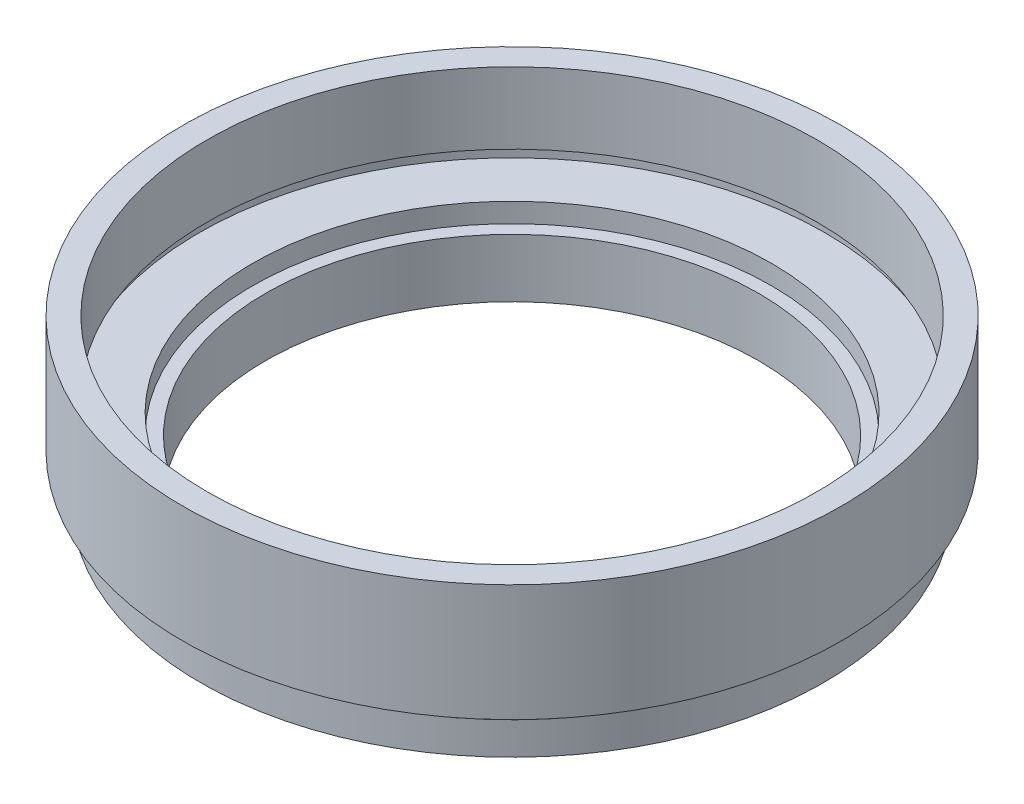
ISO-10303-21;
HEADER;
FILE_DESCRIPTION(('STEP AP214'),'2;1');
FILE_NAME('part.step','',(''),(''),'','','');
FILE_SCHEMA(('AUTOMOTIVE_DESIGN { 1 0 10303 214 1 1 1 1 }'));
ENDSEC;
DATA;
#1=APPLICATION_CONTEXT('core data for automotive mechanical design processes');
#2=APPLICATION_PROTOCOL_DEFINITION('international standard','automotive_design',2000,#1);
#3=PRODUCT_CONTEXT('',#1,'mechanical');
#4=PRODUCT('Part','Part','',(#3));
#5=PRODUCT_RELATED_PRODUCT_CATEGORY('part','',(#4));
#6=PRODUCT_DEFINITION_FORMATION('','',#4);
#7=PRODUCT_DEFINITION_CONTEXT('part definition',#1,'design');
#8=PRODUCT_DEFINITION('design','',#6,#7);
#9=PRODUCT_DEFINITION_SHAPE('','',#8);
#10=(LENGTH_UNIT() NAMED_UNIT(*) SI_UNIT(.MILLI.,.METRE.));
#11=(NAMED_UNIT(*) PLANE_ANGLE_UNIT() SI_UNIT($,.RADIAN.));
#12=(NAMED_UNIT(*) SI_UNIT($,.STERADIAN.) SOLID_ANGLE_UNIT());
#13=UNCERTAINTY_MEASURE_WITH_UNIT(LENGTH_MEASURE(1.E-05),#10,'distance_accuracy_value','');
#14=(GEOMETRIC_REPRESENTATION_CONTEXT(3) GLOBAL_UNCERTAINTY_ASSIGNED_CONTEXT((#13)) GLOBAL_UNIT_ASSIGNED_CONTEXT((#10,
#11,#12)) REPRESENTATION_CONTEXT('',''));
#15=CARTESIAN_POINT('',(0.,0.,0.));
#16=DIRECTION('',(0.,0.,1.));
#17=DIRECTION('',(1.,0.,0.));
#18=AXIS2_PLACEMENT_3D('',#15,#16,#17);
#19=CARTESIAN_POINT('',(0.,0.,0.));
#20=DIRECTION('',(0.,-1.,0.));
#21=DIRECTION('',(0.,0.,-1.));
#22=AXIS2_PLACEMENT_3D('',#19,#20,#21);
#23=CYLINDRICAL_SURFACE('',#22,19.);
#24=CARTESIAN_POINT('',(0.,0.,0.));
#25=DIRECTION('',(0.,-1.,0.));
#26=DIRECTION('',(0.,0.,-1.));
#27=AXIS2_PLACEMENT_3D('',#24,#25,#26);
#28=CIRCLE('',#27,19.);
#29=CARTESIAN_POINT('',(0.,0.,-19.));
#30=VERTEX_POINT('',#29);
#31=EDGE_CURVE('E10',#30,#30,#28,.T.);
#32=ORIENTED_EDGE('',*,*,#31,.T.);
#33=EDGE_LOOP('',(#32));
#34=FACE_BOUND('',#33,.T.);
#35=CARTESIAN_POINT('',(0.,4.5,0.));
#36=DIRECTION('',(0.,-1.,0.));
#37=DIRECTION('',(0.,0.,-1.));
#38=AXIS2_PLACEMENT_3D('',#35,#36,#37);
#39=CIRCLE('',#38,19.);
#40=CARTESIAN_POINT('',(0.,4.5,-19.));
#41=VERTEX_POINT('',#40);
#42=EDGE_CURVE('E79',#41,#41,#39,.T.);
#43=ORIENTED_EDGE('',*,*,#42,.F.);
#44=EDGE_LOOP('',(#43));
#45=FACE_BOUND('',#44,.T.);
#46=ADVANCED_FACE('F33',(#34,#45),#23,.F.);
#47=CARTESIAN_POINT('',(19.,0.,0.));
#48=DIRECTION('',(0.,-1.,0.));
#49=DIRECTION('',(0.,0.,-1.));
#50=AXIS2_PLACEMENT_3D('',#47,#48,#49);
#51=PLANE('',#50);
#52=CARTESIAN_POINT('',(0.,0.,0.));
#53=DIRECTION('',(0.,-1.,0.));
#54=DIRECTION('',(0.,0.,-1.));
#55=AXIS2_PLACEMENT_3D('',#52,#53,#54);
#56=CIRCLE('',#55,24.);
#57=CARTESIAN_POINT('',(0.,0.,-24.));
#58=VERTEX_POINT('',#57);
#59=EDGE_CURVE('E39',#58,#58,#56,.T.);
#60=ORIENTED_EDGE('',*,*,#59,.T.);
#61=EDGE_LOOP('',(#60));
#62=FACE_BOUND('',#61,.T.);
#63=ORIENTED_EDGE('',*,*,#31,.F.);
#64=EDGE_LOOP('',(#63));
#65=FACE_BOUND('',#64,.T.);
#66=ADVANCED_FACE('F87',(#62,#65),#51,.T.);
#67=CARTESIAN_POINT('',(0.,0.,0.));
#68=DIRECTION('',(0.,-1.,0.));
#69=DIRECTION('',(0.,0.,-1.));
#70=AXIS2_PLACEMENT_3D('',#67,#68,#69);
#71=CYLINDRICAL_SURFACE('',#70,24.);
#72=CARTESIAN_POINT('',(0.,2.5,0.));
#73=DIRECTION('',(0.,-1.,0.));
#74=DIRECTION('',(0.,0.,-1.));
#75=AXIS2_PLACEMENT_3D('',#72,#73,#74);
#76=CIRCLE('',#75,24.);
#77=CARTESIAN_POINT('',(0.,2.5,-24.));
#78=VERTEX_POINT('',#77);
#79=EDGE_CURVE('E43',#78,#78,#76,.T.);
#80=ORIENTED_EDGE('',*,*,#79,.T.);
#81=EDGE_LOOP('',(#80));
#82=FACE_BOUND('',#81,.T.);
#83=ORIENTED_EDGE('',*,*,#59,.F.);
#84=EDGE_LOOP('',(#83));
#85=FACE_BOUND('',#84,.T.);
#86=ADVANCED_FACE('F91',(#82,#85),#71,.T.);
#87=CARTESIAN_POINT('',(24.,2.5,0.));
#88=DIRECTION('',(0.,1.,0.));
#89=DIRECTION('',(0.,0.,1.));
#90=AXIS2_PLACEMENT_3D('',#87,#88,#89);
#91=PLANE('',#90);
#92=CARTESIAN_POINT('',(0.,2.5,0.));
#93=DIRECTION('',(0.,-1.,0.));
#94=DIRECTION('',(0.,0.,-1.));
#95=AXIS2_PLACEMENT_3D('',#92,#93,#94);
#96=CIRCLE('',#95,23.5);
#97=CARTESIAN_POINT('',(0.,2.5,-23.5));
#98=VERTEX_POINT('',#97);
#99=EDGE_CURVE('E47',#98,#98,#96,.T.);
#100=ORIENTED_EDGE('',*,*,#99,.T.);
#101=EDGE_LOOP('',(#100));
#102=FACE_BOUND('',#101,.T.);
#103=ORIENTED_EDGE('',*,*,#79,.F.);
#104=EDGE_LOOP('',(#103));
#105=FACE_BOUND('',#104,.T.);
#106=ADVANCED_FACE('F95',(#102,#105),#91,.T.);
#107=CARTESIAN_POINT('',(0.,0.,0.));
#108=DIRECTION('',(0.,-1.,0.));
#109=DIRECTION('',(0.,0.,-1.));
#110=AXIS2_PLACEMENT_3D('',#107,#108,#109);
#111=CYLINDRICAL_SURFACE('',#110,23.5);
#112=CARTESIAN_POINT('',(0.,3.5,0.));
#113=DIRECTION('',(0.,-1.,0.));
#114=DIRECTION('',(0.,0.,-1.));
#115=AXIS2_PLACEMENT_3D('',#112,#113,#114);
#116=CIRCLE('',#115,23.5);
#117=CARTESIAN_POINT('',(0.,3.5,-23.5));
#118=VERTEX_POINT('',#117);
#119=EDGE_CURVE('E52',#118,#118,#116,.T.);
#120=ORIENTED_EDGE('',*,*,#119,.T.);
#121=EDGE_LOOP('',(#120));
#122=FACE_BOUND('',#121,.T.);
#123=ORIENTED_EDGE('',*,*,#99,.F.);
#124=EDGE_LOOP('',(#123));
#125=FACE_BOUND('',#124,.T.);
#126=ADVANCED_FACE('F102',(#122,#125),#111,.T.);
#127=CARTESIAN_POINT('',(23.5,3.5,0.));
#128=DIRECTION('',(0.,-1.,0.));
#129=DIRECTION('',(0.,0.,-1.));
#130=AXIS2_PLACEMENT_3D('',#127,#128,#129);
#131=PLANE('',#130);
#132=CARTESIAN_POINT('',(0.,3.5,0.));
#133=DIRECTION('',(0.,-1.,0.));
#134=DIRECTION('',(0.,0.,-1.));
#135=AXIS2_PLACEMENT_3D('',#132,#133,#134);
#136=CIRCLE('',#135,25.4);
#137=CARTESIAN_POINT('',(0.,3.5,-25.4));
#138=VERTEX_POINT('',#137);
#139=EDGE_CURVE('E55',#138,#138,#136,.T.);
#140=ORIENTED_EDGE('',*,*,#139,.T.);
#141=EDGE_LOOP('',(#140));
#142=FACE_BOUND('',#141,.T.);
#143=ORIENTED_EDGE('',*,*,#119,.F.);
#144=EDGE_LOOP('',(#143));
#145=FACE_BOUND('',#144,.T.);
#146=ADVANCED_FACE('F106',(#142,#145),#131,.T.);
#147=CARTESIAN_POINT('',(0.,0.,0.));
#148=DIRECTION('',(0.,-1.,0.));
#149=DIRECTION('',(0.,0.,-1.));
#150=AXIS2_PLACEMENT_3D('',#147,#148,#149);
#151=CYLINDRICAL_SURFACE('',#150,25.4);
#152=CARTESIAN_POINT('',(0.,12.5,0.));
#153=DIRECTION('',(0.,-1.,0.));
#154=DIRECTION('',(0.,0.,-1.));
#155=AXIS2_PLACEMENT_3D('',#152,#153,#154);
#156=CIRCLE('',#155,25.4);
#157=CARTESIAN_POINT('',(0.,12.5,-25.4));
#158=VERTEX_POINT('',#157);
#159=EDGE_CURVE('E58',#158,#158,#156,.T.);
#160=ORIENTED_EDGE('',*,*,#159,.T.);
#161=EDGE_LOOP('',(#160));
#162=FACE_BOUND('',#161,.T.);
#163=ORIENTED_EDGE('',*,*,#139,.F.);
#164=EDGE_LOOP('',(#163));
#165=FACE_BOUND('',#164,.T.);
#166=ADVANCED_FACE('F110',(#162,#165),#151,.T.);
#167=CARTESIAN_POINT('',(25.4,12.5,0.));
#168=DIRECTION('',(0.,1.,0.));
#169=DIRECTION('',(0.,0.,1.));
#170=AXIS2_PLACEMENT_3D('',#167,#168,#169);
#171=PLANE('',#170);
#172=CARTESIAN_POINT('',(0.,12.5,0.));
#173=DIRECTION('',(0.,-1.,0.));
#174=DIRECTION('',(0.,0.,-1.));
#175=AXIS2_PLACEMENT_3D('',#172,#173,#174);
#176=CIRCLE('',#175,23.5);
#177=CARTESIAN_POINT('',(0.,12.5,-23.5));
#178=VERTEX_POINT('',#177);
#179=EDGE_CURVE('E61',#178,#178,#176,.T.);
#180=ORIENTED_EDGE('',*,*,#179,.T.);
#181=EDGE_LOOP('',(#180));
#182=FACE_BOUND('',#181,.T.);
#183=ORIENTED_EDGE('',*,*,#159,.F.);
#184=EDGE_LOOP('',(#183));
#185=FACE_BOUND('',#184,.T.);
#186=ADVANCED_FACE('F114',(#182,#185),#171,.T.);
#187=CARTESIAN_POINT('',(0.,0.,0.));
#188=DIRECTION('',(0.,-1.,0.));
#189=DIRECTION('',(0.,0.,-1.));
#190=AXIS2_PLACEMENT_3D('',#187,#188,#189);
#191=CYLINDRICAL_SURFACE('',#190,23.5);
#192=CARTESIAN_POINT('',(0.,7.,0.));
#193=DIRECTION('',(0.,-1.,0.));
#194=DIRECTION('',(0.,0.,-1.));
#195=AXIS2_PLACEMENT_3D('',#192,#193,#194);
#196=CIRCLE('',#195,23.5);
#197=CARTESIAN_POINT('',(0.,7.,-23.5));
#198=VERTEX_POINT('',#197);
#199=EDGE_CURVE('E64',#198,#198,#196,.T.);
#200=ORIENTED_EDGE('',*,*,#199,.T.);
#201=EDGE_LOOP('',(#200));
#202=FACE_BOUND('',#201,.T.);
#203=ORIENTED_EDGE('',*,*,#179,.F.);
#204=EDGE_LOOP('',(#203));
#205=FACE_BOUND('',#204,.T.);
#206=ADVANCED_FACE('F118',(#202,#205),#191,.F.);
#207=CARTESIAN_POINT('',(23.5,7.,0.));
#208=DIRECTION('',(0.,-1.,0.));
#209=DIRECTION('',(0.,0.,-1.));
#210=AXIS2_PLACEMENT_3D('',#207,#208,#209);
#211=PLANE('',#210);
#212=CARTESIAN_POINT('',(0.,7.,0.));
#213=DIRECTION('',(0.,-1.,0.));
#214=DIRECTION('',(0.,0.,-1.));
#215=AXIS2_PLACEMENT_3D('',#212,#213,#214);
#216=CIRCLE('',#215,24.1);
#217=CARTESIAN_POINT('',(0.,7.,-24.1));
#218=VERTEX_POINT('',#217);
#219=EDGE_CURVE('E67',#218,#218,#216,.T.);
#220=ORIENTED_EDGE('',*,*,#219,.T.);
#221=EDGE_LOOP('',(#220));
#222=FACE_BOUND('',#221,.T.);
#223=ORIENTED_EDGE('',*,*,#199,.F.);
#224=EDGE_LOOP('',(#223));
#225=FACE_BOUND('',#224,.T.);
#226=ADVANCED_FACE('F122',(#222,#225),#211,.T.);
#227=CARTESIAN_POINT('',(0.,0.,0.));
#228=DIRECTION('',(0.,-1.,0.));
#229=DIRECTION('',(0.,0.,-1.));
#230=AXIS2_PLACEMENT_3D('',#227,#228,#229);
#231=CYLINDRICAL_SURFACE('',#230,24.1);
#232=CARTESIAN_POINT('',(0.,6.,0.));
#233=DIRECTION('',(0.,-1.,0.));
#234=DIRECTION('',(0.,0.,-1.));
#235=AXIS2_PLACEMENT_3D('',#232,#233,#234);
#236=CIRCLE('',#235,24.1);
#237=CARTESIAN_POINT('',(0.,6.,-24.1));
#238=VERTEX_POINT('',#237);
#239=EDGE_CURVE('E70',#238,#238,#236,.T.);
#240=ORIENTED_EDGE('',*,*,#239,.T.);
#241=EDGE_LOOP('',(#240));
#242=FACE_BOUND('',#241,.T.);
#243=ORIENTED_EDGE('',*,*,#219,.F.);
#244=EDGE_LOOP('',(#243));
#245=FACE_BOUND('',#244,.T.);
#246=ADVANCED_FACE('F126',(#242,#245),#231,.F.);
#247=CARTESIAN_POINT('',(24.1,6.,0.));
#248=DIRECTION('',(0.,1.,0.));
#249=DIRECTION('',(0.,0.,1.));
#250=AXIS2_PLACEMENT_3D('',#247,#248,#249);
#251=PLANE('',#250);
#252=CARTESIAN_POINT('',(0.,6.,0.));
#253=DIRECTION('',(0.,-1.,0.));
#254=DIRECTION('',(0.,0.,-1.));
#255=AXIS2_PLACEMENT_3D('',#252,#253,#254);
#256=CIRCLE('',#255,20.);
#257=CARTESIAN_POINT('',(0.,6.,-20.));
#258=VERTEX_POINT('',#257);
#259=EDGE_CURVE('E73',#258,#258,#256,.T.);
#260=ORIENTED_EDGE('',*,*,#259,.T.);
#261=EDGE_LOOP('',(#260));
#262=FACE_BOUND('',#261,.T.);
#263=ORIENTED_EDGE('',*,*,#239,.F.);
#264=EDGE_LOOP('',(#263));
#265=FACE_BOUND('',#264,.T.);
#266=ADVANCED_FACE('F130',(#262,#265),#251,.T.);
#267=CARTESIAN_POINT('',(0.,0.,0.));
#268=DIRECTION('',(0.,-1.,0.));
#269=DIRECTION('',(0.,0.,-1.));
#270=AXIS2_PLACEMENT_3D('',#267,#268,#269);
#271=CYLINDRICAL_SURFACE('',#270,20.);
#272=CARTESIAN_POINT('',(0.,4.5,0.));
#273=DIRECTION('',(0.,-1.,0.));
#274=DIRECTION('',(0.,0.,-1.));
#275=AXIS2_PLACEMENT_3D('',#272,#273,#274);
#276=CIRCLE('',#275,20.);
#277=CARTESIAN_POINT('',(0.,4.5,-20.));
#278=VERTEX_POINT('',#277);
#279=EDGE_CURVE('E76',#278,#278,#276,.T.);
#280=ORIENTED_EDGE('',*,*,#279,.T.);
#281=EDGE_LOOP('',(#280));
#282=FACE_BOUND('',#281,.T.);
#283=ORIENTED_EDGE('',*,*,#259,.F.);
#284=EDGE_LOOP('',(#283));
#285=FACE_BOUND('',#284,.T.);
#286=ADVANCED_FACE('F134',(#282,#285),#271,.F.);
#287=CARTESIAN_POINT('',(20.,4.5,0.));
#288=DIRECTION('',(0.,1.,0.));
#289=DIRECTION('',(0.,0.,1.));
#290=AXIS2_PLACEMENT_3D('',#287,#288,#289);
#291=PLANE('',#290);
#292=ORIENTED_EDGE('',*,*,#42,.T.);
#293=EDGE_LOOP('',(#292));
#294=FACE_BOUND('',#293,.T.);
#295=ORIENTED_EDGE('',*,*,#279,.F.);
#296=EDGE_LOOP('',(#295));
#297=FACE_BOUND('',#296,.T.);
#298=ADVANCED_FACE('F83',(#294,#297),#291,.T.);
#299=CLOSED_SHELL('',(#46,#66,#86,#106,#126,#146,#166,#186,#206,#226,#246,#266,#286,#298));
#300=MANIFOLD_SOLID_BREP('B2',#299);
#301=ADVANCED_BREP_SHAPE_REPRESENTATION('',(#18,#300),#14);
#302=SHAPE_DEFINITION_REPRESENTATION(#9,#301);
ENDSEC;
END-ISO-10303-21;
